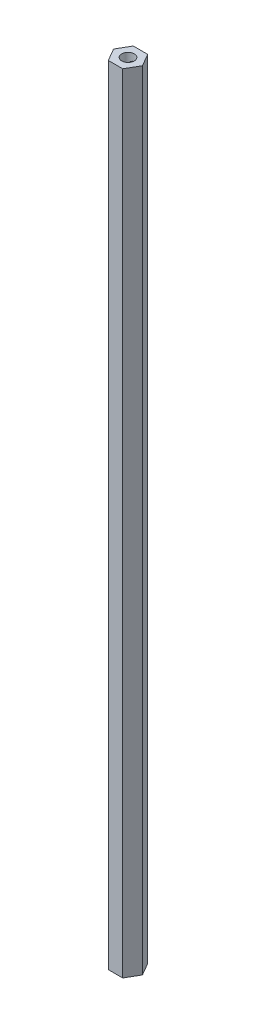
ISO-10303-21;
HEADER;
FILE_DESCRIPTION(('STEP AP214'),'2;1');
FILE_NAME('part.step','',(''),(''),'','','');
FILE_SCHEMA(('AUTOMOTIVE_DESIGN { 1 0 10303 214 1 1 1 1 }'));
ENDSEC;
DATA;
#1=APPLICATION_CONTEXT('core data for automotive mechanical design processes');
#2=APPLICATION_PROTOCOL_DEFINITION('international standard','automotive_design',2000,#1);
#3=PRODUCT_CONTEXT('',#1,'mechanical');
#4=PRODUCT('Part','Part','',(#3));
#5=PRODUCT_RELATED_PRODUCT_CATEGORY('part','',(#4));
#6=PRODUCT_DEFINITION_FORMATION('','',#4);
#7=PRODUCT_DEFINITION_CONTEXT('part definition',#1,'design');
#8=PRODUCT_DEFINITION('design','',#6,#7);
#9=PRODUCT_DEFINITION_SHAPE('','',#8);
#10=(LENGTH_UNIT() NAMED_UNIT(*) SI_UNIT(.MILLI.,.METRE.));
#11=(NAMED_UNIT(*) PLANE_ANGLE_UNIT() SI_UNIT($,.RADIAN.));
#12=(NAMED_UNIT(*) SI_UNIT($,.STERADIAN.) SOLID_ANGLE_UNIT());
#13=UNCERTAINTY_MEASURE_WITH_UNIT(LENGTH_MEASURE(1.E-05),#10,'distance_accuracy_value','');
#14=(GEOMETRIC_REPRESENTATION_CONTEXT(3) GLOBAL_UNCERTAINTY_ASSIGNED_CONTEXT((#13)) GLOBAL_UNIT_ASSIGNED_CONTEXT((#10,
#11,#12)) REPRESENTATION_CONTEXT('',''));
#15=CARTESIAN_POINT('',(0.,0.,0.));
#16=DIRECTION('',(0.,0.,1.));
#17=DIRECTION('',(1.,0.,0.));
#18=AXIS2_PLACEMENT_3D('',#15,#16,#17);
#19=CARTESIAN_POINT('',(3.66617420935412,200.,6.35));
#20=DIRECTION('',(-0.866025403784439,0.,-0.5));
#21=DIRECTION('',(-0.5,0.,0.866025403784439));
#22=AXIS2_PLACEMENT_3D('',#19,#20,#21);
#23=PLANE('',#22);
#24=DIRECTION('',(0.5,0.,-0.866025403784439));
#25=VECTOR('',#24,1.);
#26=CARTESIAN_POINT('',(3.66617420935412,-200.,6.35));
#27=LINE('',#26,#25);
#28=CARTESIAN_POINT('',(3.66617420935412,-200.,6.35));
#29=VERTEX_POINT('',#28);
#30=CARTESIAN_POINT('',(7.33234841870825,-200.,0.));
#31=VERTEX_POINT('',#30);
#32=EDGE_CURVE('E123',#29,#31,#27,.T.);
#33=ORIENTED_EDGE('',*,*,#32,.T.);
#34=DIRECTION('',(0.,-1.,0.));
#35=VECTOR('',#34,1.);
#36=CARTESIAN_POINT('',(7.33234841870825,200.,0.));
#37=LINE('',#36,#35);
#38=CARTESIAN_POINT('',(7.33234841870825,200.,0.));
#39=VERTEX_POINT('',#38);
#40=EDGE_CURVE('E11',#39,#31,#37,.T.);
#41=ORIENTED_EDGE('',*,*,#40,.F.);
#42=DIRECTION('',(0.5,0.,-0.866025403784439));
#43=VECTOR('',#42,1.);
#44=CARTESIAN_POINT('',(3.66617420935412,200.,6.35));
#45=LINE('',#44,#43);
#46=CARTESIAN_POINT('',(3.66617420935412,200.,6.35));
#47=VERTEX_POINT('',#46);
#48=EDGE_CURVE('E134',#47,#39,#45,.T.);
#49=ORIENTED_EDGE('',*,*,#48,.F.);
#50=DIRECTION('',(0.,-1.,0.));
#51=VECTOR('',#50,1.);
#52=CARTESIAN_POINT('',(3.66617420935412,200.,6.35));
#53=LINE('',#52,#51);
#54=EDGE_CURVE('E119',#47,#29,#53,.T.);
#55=ORIENTED_EDGE('',*,*,#54,.T.);
#56=EDGE_LOOP('',(#33,#41,#49,#55));
#57=FACE_BOUND('',#56,.T.);
#58=ADVANCED_FACE('F36',(#57),#23,.F.);
#59=CARTESIAN_POINT('',(7.33234841870825,200.,0.));
#60=DIRECTION('',(-0.866025403784438,0.,0.5));
#61=DIRECTION('',(0.5,0.,0.866025403784439));
#62=AXIS2_PLACEMENT_3D('',#59,#60,#61);
#63=PLANE('',#62);
#64=DIRECTION('',(-0.5,0.,-0.866025403784438));
#65=VECTOR('',#64,1.);
#66=CARTESIAN_POINT('',(7.33234841870825,-200.,0.));
#67=LINE('',#66,#65);
#68=CARTESIAN_POINT('',(3.66617420935412,-200.,-6.35));
#69=VERTEX_POINT('',#68);
#70=EDGE_CURVE('E126',#31,#69,#67,.T.);
#71=ORIENTED_EDGE('',*,*,#70,.T.);
#72=DIRECTION('',(0.,-1.,0.));
#73=VECTOR('',#72,1.);
#74=CARTESIAN_POINT('',(3.66617420935412,200.,-6.35));
#75=LINE('',#74,#73);
#76=CARTESIAN_POINT('',(3.66617420935412,200.,-6.35));
#77=VERTEX_POINT('',#76);
#78=EDGE_CURVE('E44',#77,#69,#75,.T.);
#79=ORIENTED_EDGE('',*,*,#78,.F.);
#80=DIRECTION('',(-0.5,0.,-0.866025403784438));
#81=VECTOR('',#80,1.);
#82=CARTESIAN_POINT('',(7.33234841870825,200.,0.));
#83=LINE('',#82,#81);
#84=EDGE_CURVE('E90',#39,#77,#83,.T.);
#85=ORIENTED_EDGE('',*,*,#84,.F.);
#86=ORIENTED_EDGE('',*,*,#40,.T.);
#87=EDGE_LOOP('',(#71,#79,#85,#86));
#88=FACE_BOUND('',#87,.T.);
#89=ADVANCED_FACE('F162',(#88),#63,.F.);
#90=CARTESIAN_POINT('',(3.66617420935412,200.,-6.35));
#91=DIRECTION('',(0.,0.,1.));
#92=DIRECTION('',(1.,0.,0.));
#93=AXIS2_PLACEMENT_3D('',#90,#91,#92);
#94=PLANE('',#93);
#95=CARTESIAN_POINT('',(0.,-194.,-6.35));
#96=DIRECTION('',(0.,0.,-1.));
#97=DIRECTION('',(-1.,0.,0.));
#98=AXIS2_PLACEMENT_3D('',#95,#96,#97);
#99=CIRCLE('',#98,2.49999999999999);
#100=CARTESIAN_POINT('',(-2.49999999999999,-194.,-6.35));
#101=VERTEX_POINT('',#100);
#102=EDGE_CURVE('E337',#101,#101,#99,.T.);
#103=ORIENTED_EDGE('',*,*,#102,.F.);
#104=EDGE_LOOP('',(#103));
#105=FACE_BOUND('',#104,.T.);
#106=CARTESIAN_POINT('',(0.,194.,-6.35));
#107=DIRECTION('',(0.,0.,-1.));
#108=DIRECTION('',(-1.,0.,0.));
#109=AXIS2_PLACEMENT_3D('',#106,#107,#108);
#110=CIRCLE('',#109,2.49999999999999);
#111=CARTESIAN_POINT('',(-2.49999999999999,194.,-6.35));
#112=VERTEX_POINT('',#111);
#113=EDGE_CURVE('E309',#112,#112,#110,.T.);
#114=ORIENTED_EDGE('',*,*,#113,.F.);
#115=EDGE_LOOP('',(#114));
#116=FACE_BOUND('',#115,.T.);
#117=DIRECTION('',(-1.,0.,0.));
#118=VECTOR('',#117,1.);
#119=CARTESIAN_POINT('',(3.66617420935412,-200.,-6.35));
#120=LINE('',#119,#118);
#121=CARTESIAN_POINT('',(-3.66617420935412,-200.,-6.35));
#122=VERTEX_POINT('',#121);
#123=EDGE_CURVE('E129',#69,#122,#120,.T.);
#124=ORIENTED_EDGE('',*,*,#123,.T.);
#125=DIRECTION('',(0.,-1.,0.));
#126=VECTOR('',#125,1.);
#127=CARTESIAN_POINT('',(-3.66617420935412,200.,-6.35));
#128=LINE('',#127,#126);
#129=CARTESIAN_POINT('',(-3.66617420935412,200.,-6.35));
#130=VERTEX_POINT('',#129);
#131=EDGE_CURVE('E114',#130,#122,#128,.T.);
#132=ORIENTED_EDGE('',*,*,#131,.F.);
#133=DIRECTION('',(-1.,0.,0.));
#134=VECTOR('',#133,1.);
#135=CARTESIAN_POINT('',(3.66617420935412,200.,-6.35));
#136=LINE('',#135,#134);
#137=EDGE_CURVE('E105',#77,#130,#136,.T.);
#138=ORIENTED_EDGE('',*,*,#137,.F.);
#139=ORIENTED_EDGE('',*,*,#78,.T.);
#140=EDGE_LOOP('',(#124,#132,#138,#139));
#141=FACE_BOUND('',#140,.T.);
#142=ADVANCED_FACE('F140',(#105,#116,#141),#94,.F.);
#143=CARTESIAN_POINT('',(-3.66617420935412,200.,-6.35));
#144=DIRECTION('',(0.866025403784439,0.,0.5));
#145=DIRECTION('',(0.5,0.,-0.866025403784439));
#146=AXIS2_PLACEMENT_3D('',#143,#144,#145);
#147=PLANE('',#146);
#148=DIRECTION('',(-0.5,0.,0.866025403784439));
#149=VECTOR('',#148,1.);
#150=CARTESIAN_POINT('',(-3.66617420935412,-200.,-6.35));
#151=LINE('',#150,#149);
#152=CARTESIAN_POINT('',(-7.33234841870825,-200.,0.));
#153=VERTEX_POINT('',#152);
#154=EDGE_CURVE('E113',#122,#153,#151,.T.);
#155=ORIENTED_EDGE('',*,*,#154,.T.);
#156=DIRECTION('',(0.,-1.,0.));
#157=VECTOR('',#156,1.);
#158=CARTESIAN_POINT('',(-7.33234841870825,200.,0.));
#159=LINE('',#158,#157);
#160=CARTESIAN_POINT('',(-7.33234841870825,200.,0.));
#161=VERTEX_POINT('',#160);
#162=EDGE_CURVE('E110',#161,#153,#159,.T.);
#163=ORIENTED_EDGE('',*,*,#162,.F.);
#164=DIRECTION('',(-0.5,0.,0.866025403784439));
#165=VECTOR('',#164,1.);
#166=CARTESIAN_POINT('',(-3.66617420935412,200.,-6.35));
#167=LINE('',#166,#165);
#168=EDGE_CURVE('E99',#130,#161,#167,.T.);
#169=ORIENTED_EDGE('',*,*,#168,.F.);
#170=ORIENTED_EDGE('',*,*,#131,.T.);
#171=EDGE_LOOP('',(#155,#163,#169,#170));
#172=FACE_BOUND('',#171,.T.);
#173=ADVANCED_FACE('F111',(#172),#147,.F.);
#174=CARTESIAN_POINT('',(-7.33234841870825,200.,0.));
#175=DIRECTION('',(0.866025403784439,0.,-0.5));
#176=DIRECTION('',(-0.5,0.,-0.866025403784439));
#177=AXIS2_PLACEMENT_3D('',#174,#175,#176);
#178=PLANE('',#177);
#179=CARTESIAN_POINT('',(-5.49926131403119,194.,3.175));
#180=DIRECTION('',(-0.866025403784438,0.,0.5));
#181=DIRECTION('',(0.5,0.,0.866025403784439));
#182=AXIS2_PLACEMENT_3D('',#179,#180,#181);
#183=CIRCLE('',#182,2.49999999999997);
#184=CARTESIAN_POINT('',(-4.2492613140312,194.,5.34006350946108));
#185=VERTEX_POINT('',#184);
#186=EDGE_CURVE('E358',#185,#185,#183,.T.);
#187=ORIENTED_EDGE('',*,*,#186,.F.);
#188=EDGE_LOOP('',(#187));
#189=FACE_BOUND('',#188,.T.);
#190=CARTESIAN_POINT('',(-5.49926131403119,-194.,3.175));
#191=DIRECTION('',(-0.866025403784438,0.,0.5));
#192=DIRECTION('',(0.5,0.,0.866025403784439));
#193=AXIS2_PLACEMENT_3D('',#190,#191,#192);
#194=CIRCLE('',#193,2.5);
#195=CARTESIAN_POINT('',(-4.24926131403119,-194.,5.3400635094611));
#196=VERTEX_POINT('',#195);
#197=EDGE_CURVE('E350',#196,#196,#194,.T.);
#198=ORIENTED_EDGE('',*,*,#197,.F.);
#199=EDGE_LOOP('',(#198));
#200=FACE_BOUND('',#199,.T.);
#201=DIRECTION('',(0.5,0.,0.866025403784439));
#202=VECTOR('',#201,1.);
#203=CARTESIAN_POINT('',(-7.33234841870825,-200.,0.));
#204=LINE('',#203,#202);
#205=CARTESIAN_POINT('',(-3.66617420935412,-200.,6.35));
#206=VERTEX_POINT('',#205);
#207=EDGE_CURVE('E76',#153,#206,#204,.T.);
#208=ORIENTED_EDGE('',*,*,#207,.T.);
#209=DIRECTION('',(0.,-1.,0.));
#210=VECTOR('',#209,1.);
#211=CARTESIAN_POINT('',(-3.66617420935412,200.,6.35));
#212=LINE('',#211,#210);
#213=CARTESIAN_POINT('',(-3.66617420935412,200.,6.35));
#214=VERTEX_POINT('',#213);
#215=EDGE_CURVE('E115',#214,#206,#212,.T.);
#216=ORIENTED_EDGE('',*,*,#215,.F.);
#217=DIRECTION('',(0.5,0.,0.866025403784439));
#218=VECTOR('',#217,1.);
#219=CARTESIAN_POINT('',(-7.33234841870825,200.,0.));
#220=LINE('',#219,#218);
#221=EDGE_CURVE('E103',#161,#214,#220,.T.);
#222=ORIENTED_EDGE('',*,*,#221,.F.);
#223=ORIENTED_EDGE('',*,*,#162,.T.);
#224=EDGE_LOOP('',(#208,#216,#222,#223));
#225=FACE_BOUND('',#224,.T.);
#226=ADVANCED_FACE('F117',(#189,#200,#225),#178,.F.);
#227=CARTESIAN_POINT('',(-3.66617420935412,200.,6.35));
#228=DIRECTION('',(0.,0.,-1.));
#229=DIRECTION('',(-1.,0.,0.));
#230=AXIS2_PLACEMENT_3D('',#227,#228,#229);
#231=PLANE('',#230);
#232=DIRECTION('',(1.,0.,0.));
#233=VECTOR('',#232,1.);
#234=CARTESIAN_POINT('',(-3.66617420935412,-200.,6.35));
#235=LINE('',#234,#233);
#236=EDGE_CURVE('E82',#206,#29,#235,.T.);
#237=ORIENTED_EDGE('',*,*,#236,.T.);
#238=ORIENTED_EDGE('',*,*,#54,.F.);
#239=DIRECTION('',(1.,0.,0.));
#240=VECTOR('',#239,1.);
#241=CARTESIAN_POINT('',(-3.66617420935412,200.,6.35));
#242=LINE('',#241,#240);
#243=EDGE_CURVE('E52',#214,#47,#242,.T.);
#244=ORIENTED_EDGE('',*,*,#243,.F.);
#245=ORIENTED_EDGE('',*,*,#215,.T.);
#246=EDGE_LOOP('',(#237,#238,#244,#245));
#247=FACE_BOUND('',#246,.T.);
#248=ADVANCED_FACE('F147',(#247),#231,.F.);
#249=CARTESIAN_POINT('',(0.,200.,0.));
#250=DIRECTION('',(0.,1.,0.));
#251=DIRECTION('',(0.,0.,1.));
#252=AXIS2_PLACEMENT_3D('',#249,#250,#251);
#253=PLANE('',#252);
#254=CARTESIAN_POINT('',(0.,200.,0.));
#255=DIRECTION('',(0.,1.,0.));
#256=DIRECTION('',(0.,0.,1.));
#257=AXIS2_PLACEMENT_3D('',#254,#255,#256);
#258=CIRCLE('',#257,3.175);
#259=CARTESIAN_POINT('',(0.,200.,3.175));
#260=VERTEX_POINT('',#259);
#261=EDGE_CURVE('E316',#260,#260,#258,.T.);
#262=ORIENTED_EDGE('',*,*,#261,.F.);
#263=EDGE_LOOP('',(#262));
#264=FACE_BOUND('',#263,.T.);
#265=ORIENTED_EDGE('',*,*,#48,.T.);
#266=ORIENTED_EDGE('',*,*,#84,.T.);
#267=ORIENTED_EDGE('',*,*,#137,.T.);
#268=ORIENTED_EDGE('',*,*,#168,.T.);
#269=ORIENTED_EDGE('',*,*,#221,.T.);
#270=ORIENTED_EDGE('',*,*,#243,.T.);
#271=EDGE_LOOP('',(#265,#266,#267,#268,#269,#270));
#272=FACE_BOUND('',#271,.T.);
#273=ADVANCED_FACE('F101',(#264,#272),#253,.T.);
#274=CARTESIAN_POINT('',(0.,-200.,0.));
#275=DIRECTION('',(0.,1.,0.));
#276=DIRECTION('',(0.,0.,1.));
#277=AXIS2_PLACEMENT_3D('',#274,#275,#276);
#278=PLANE('',#277);
#279=CARTESIAN_POINT('',(0.,-200.,0.));
#280=DIRECTION('',(0.,-1.,0.));
#281=DIRECTION('',(0.,0.,-1.));
#282=AXIS2_PLACEMENT_3D('',#279,#280,#281);
#283=CIRCLE('',#282,3.175);
#284=CARTESIAN_POINT('',(0.,-200.,-3.175));
#285=VERTEX_POINT('',#284);
#286=EDGE_CURVE('E308',#285,#285,#283,.T.);
#287=ORIENTED_EDGE('',*,*,#286,.F.);
#288=EDGE_LOOP('',(#287));
#289=FACE_BOUND('',#288,.T.);
#290=ORIENTED_EDGE('',*,*,#32,.F.);
#291=ORIENTED_EDGE('',*,*,#236,.F.);
#292=ORIENTED_EDGE('',*,*,#207,.F.);
#293=ORIENTED_EDGE('',*,*,#154,.F.);
#294=ORIENTED_EDGE('',*,*,#123,.F.);
#295=ORIENTED_EDGE('',*,*,#70,.F.);
#296=EDGE_LOOP('',(#290,#291,#292,#293,#294,#295));
#297=FACE_BOUND('',#296,.T.);
#298=ADVANCED_FACE('F143',(#289,#297),#278,.F.);
#299=CARTESIAN_POINT('',(0.,180.,0.));
#300=DIRECTION('',(0.,1.,0.));
#301=DIRECTION('',(0.,0.,1.));
#302=AXIS2_PLACEMENT_3D('',#299,#300,#301);
#303=CONICAL_SURFACE('',#302,3.17499999999999,1.02974425867665);
#304=CARTESIAN_POINT('',(0.,178.092267534588,0.));
#305=VERTEX_POINT('',#304);
#306=VERTEX_LOOP('',#305);
#307=FACE_BOUND('',#306,.T.);
#308=CARTESIAN_POINT('',(0.,180.,0.));
#309=DIRECTION('',(0.,1.,0.));
#310=DIRECTION('',(0.,0.,1.));
#311=AXIS2_PLACEMENT_3D('',#308,#309,#310);
#312=CIRCLE('',#311,3.17499999999999);
#313=CARTESIAN_POINT('',(0.,180.,3.17499999999999));
#314=VERTEX_POINT('',#313);
#315=EDGE_CURVE('E127',#314,#314,#312,.T.);
#316=ORIENTED_EDGE('',*,*,#315,.T.);
#317=EDGE_LOOP('',(#316));
#318=FACE_BOUND('',#317,.T.);
#319=ADVANCED_FACE('F199',(#307,#318),#303,.F.);
#320=CARTESIAN_POINT('',(0.,200.,0.));
#321=DIRECTION('',(0.,1.,0.));
#322=DIRECTION('',(0.,0.,1.));
#323=AXIS2_PLACEMENT_3D('',#320,#321,#322);
#324=CYLINDRICAL_SURFACE('',#323,3.175);
#325=CARTESIAN_POINT('',(-0.444983406998439,194.,3.14366263576358));
#326=CARTESIAN_POINT('',(-0.444996995344941,194.095780677247,3.14366409823169));
#327=CARTESIAN_POINT('',(-0.453979292016389,194.191731641422,3.14242862568083));
#328=CARTESIAN_POINT('',(-0.488470053402809,194.380637183561,3.13724406145098));
#329=CARTESIAN_POINT('',(-0.514033143210928,194.47358078741,3.13328599763252));
#330=CARTESIAN_POINT('',(-0.589118769872573,194.684767129696,3.12016598165727));
#331=CARTESIAN_POINT('',(-0.643796857771062,194.801065533529,3.10970568433576));
#332=CARTESIAN_POINT('',(-0.768949157633939,195.023872040012,3.08114633052032));
#333=CARTESIAN_POINT('',(-0.839466137320342,195.130352513521,3.06302647282521));
#334=CARTESIAN_POINT('',(-0.965597202759653,195.299744498159,3.02506979644189));
#335=CARTESIAN_POINT('',(-1.01838658621612,195.365384371508,3.00780016564516));
#336=CARTESIAN_POINT('',(-1.12739762372617,195.492307509817,2.96866284608294));
#337=CARTESIAN_POINT('',(-1.18362042641613,195.553589301792,2.94679361249255));
#338=CARTESIAN_POINT('',(-1.35584862884774,195.730646780123,2.87363753783605));
#339=CARTESIAN_POINT('',(-1.47560906394775,195.839887085861,2.81474932139681));
#340=CARTESIAN_POINT('',(-1.69482075810722,196.018987095228,2.68721168505667));
#341=CARTESIAN_POINT('',(-1.7937580375787,196.092380990213,2.62260537081372));
#342=CARTESIAN_POINT('',(-1.9899582836853,196.223490113705,2.4770015756832));
#343=CARTESIAN_POINT('',(-2.08722358792458,196.281229243389,2.39602941536086));
#344=CARTESIAN_POINT('',(-2.26098041361335,196.370457703207,2.23171691009273));
#345=CARTESIAN_POINT('',(-2.33833043073598,196.404649565264,2.15075982971843));
#346=CARTESIAN_POINT('',(-2.48602281449163,196.458072396592,1.9781765706414));
#347=CARTESIAN_POINT('',(-2.55636892439218,196.477311395313,1.88655614841826));
#348=CARTESIAN_POINT('',(-2.68756521837787,196.499664553648,1.69445694953954));
#349=CARTESIAN_POINT('',(-2.74838429450358,196.502726915701,1.59395076380011));
#350=CARTESIAN_POINT('',(-2.85818395676486,196.492373548854,1.38747380249844));
#351=CARTESIAN_POINT('',(-2.90716363798289,196.478956560866,1.28150260998133));
#352=CARTESIAN_POINT('',(-2.99019564917554,196.437609594302,1.07300039430847));
#353=CARTESIAN_POINT('',(-3.02487249715819,196.410439755988,0.970562719078406));
#354=CARTESIAN_POINT('',(-3.08287172627453,196.34344231111,0.766665103452073));
#355=CARTESIAN_POINT('',(-3.1061913234747,196.303611605014,0.665205408750355));
#356=CARTESIAN_POINT('',(-3.14413483953365,196.208358018,0.455520057201279));
#357=CARTESIAN_POINT('',(-3.15766139846145,196.151777320051,0.34762694266734));
#358=CARTESIAN_POINT('',(-3.17375394533734,196.027150814043,0.137841664316999));
#359=CARTESIAN_POINT('',(-3.17631300743305,195.959097789515,0.0359533324891913));
#360=CARTESIAN_POINT('',(-3.17207891807633,195.798046904593,-0.180237157481917));
#361=CARTESIAN_POINT('',(-3.16326639285654,195.702793771299,-0.292817438603984));
#362=CARTESIAN_POINT('',(-3.13649663375655,195.499150689941,-0.504356184525455));
#363=CARTESIAN_POINT('',(-3.11852979120149,195.390747029924,-0.603300197323241));
#364=CARTESIAN_POINT('',(-3.08066460710913,195.175864497173,-0.77242866724904));
#365=CARTESIAN_POINT('',(-3.06130770997906,195.070914719527,-0.844673166697866));
#366=CARTESIAN_POINT('',(-3.02318046049082,194.851127192214,-0.972330891804104));
#367=CARTESIAN_POINT('',(-3.0044089007141,194.736311925304,-1.02778114952163));
#368=CARTESIAN_POINT('',(-2.97699540721517,194.530124355241,-1.10422524577204));
#369=CARTESIAN_POINT('',(-2.96698714959803,194.440921231107,-1.13049431076655));
#370=CARTESIAN_POINT('',(-2.95214078992384,194.25913829552,-1.16872824736811));
#371=CARTESIAN_POINT('',(-2.94729233491295,194.166565632599,-1.18072176808135));
#372=CARTESIAN_POINT('',(-2.94397870378626,193.980172669485,-1.18896716163643));
#373=CARTESIAN_POINT('',(-2.94554115377461,193.886348709928,-1.18515090573291));
#374=CARTESIAN_POINT('',(-2.95468816449602,193.700866915356,-1.16214412069451));
#375=CARTESIAN_POINT('',(-2.96228158924884,193.609212473331,-1.14293096160123));
#376=CARTESIAN_POINT('',(-2.98447292579285,193.404591409255,-1.08387468969428));
#377=CARTESIAN_POINT('',(-3.0004556251488,193.293057233768,-1.0396934846267));
#378=CARTESIAN_POINT('',(-3.0348509470372,193.078496850353,-0.93453408110223));
#379=CARTESIAN_POINT('',(-3.05327095785951,192.975498124972,-0.873504171882924));
#380=CARTESIAN_POINT('',(-3.08345726580705,192.807487413017,-0.758513458775513));
#381=CARTESIAN_POINT('',(-3.09557809260628,192.740261539143,-0.70781478830425));
#382=CARTESIAN_POINT('',(-3.11810525896758,192.610062051195,-0.600863634532556));
#383=CARTESIAN_POINT('',(-3.12851091920268,192.547090127787,-0.544608964703947));
#384=CARTESIAN_POINT('',(-3.15575480492486,192.364654126467,-0.368609587759333));
#385=CARTESIAN_POINT('',(-3.16865621578096,192.251494658765,-0.24150596088291));
#386=CARTESIAN_POINT('',(-3.17706273963447,192.059783522563,0.00753809139718041));
#387=CARTESIAN_POINT('',(-3.17489333970609,191.978586488259,0.127377716304884));
#388=CARTESIAN_POINT('',(-3.15517752618242,191.832284351849,0.375318088926815));
#389=CARTESIAN_POINT('',(-3.13765738805521,191.767151996251,0.503404374108776));
#390=CARTESIAN_POINT('',(-3.08922922944145,191.665920488682,0.74115483298181));
#391=CARTESIAN_POINT('',(-3.06122510126526,191.626727500394,0.850086980584443));
#392=CARTESIAN_POINT('',(-2.99209795738313,191.563312005294,1.06818828250139));
#393=CARTESIAN_POINT('',(-2.95098246264799,191.539080939332,1.17735726539235));
#394=CARTESIAN_POINT('',(-2.85558260955112,191.507013303709,1.39291552735472));
#395=CARTESIAN_POINT('',(-2.80124350309638,191.499246230839,1.49929115859066));
#396=CARTESIAN_POINT('',(-2.68093926258766,191.500869366647,1.70510771239568));
#397=CARTESIAN_POINT('',(-2.61497493363347,191.510258387609,1.80454911452665));
#398=CARTESIAN_POINT('',(-2.47879244711097,191.544309199585,1.98703299358433));
#399=CARTESIAN_POINT('',(-2.40917156561584,191.56788528113,2.07073142597999));
#400=CARTESIAN_POINT('',(-2.26446409214146,191.628067071007,2.22806256117058));
#401=CARTESIAN_POINT('',(-2.18937617870367,191.664675937919,2.30169281788476));
#402=CARTESIAN_POINT('',(-2.03000450061623,191.75273991491,2.44376761013906));
#403=CARTESIAN_POINT('',(-1.945465205361,191.80514706531,2.51132862259258));
#404=CARTESIAN_POINT('',(-1.77547816862767,191.92143029909,2.63425982039957));
#405=CARTESIAN_POINT('',(-1.69003001685843,191.985311788796,2.68962423162438));
#406=CARTESIAN_POINT('',(-1.50393550772983,192.136548284109,2.7986771328254));
#407=CARTESIAN_POINT('',(-1.40359617977823,192.22604974276,2.84990604641452));
#408=CARTESIAN_POINT('',(-1.20869490782708,192.417773864809,2.93787723339006));
#409=CARTESIAN_POINT('',(-1.11414085871496,192.52001335822,2.97460006794249));
#410=CARTESIAN_POINT('',(-0.938919129174925,192.732335205912,3.03434823141605));
#411=CARTESIAN_POINT('',(-0.857851615220983,192.841951090643,3.05785538381985));
#412=CARTESIAN_POINT('',(-0.711047686522316,193.072586988351,3.09527837523737));
#413=CARTESIAN_POINT('',(-0.645283472637669,193.193585753125,3.10921169693508));
#414=CARTESIAN_POINT('',(-0.553790332391528,193.408633270412,3.12656969268792));
#415=CARTESIAN_POINT('',(-0.521970046279559,193.499909800105,3.13189141461957));
#416=CARTESIAN_POINT('',(-0.473775656465832,193.686454628027,3.13955102754845));
#417=CARTESIAN_POINT('',(-0.457343113615132,193.781706376884,3.14190021958342));
#418=CARTESIAN_POINT('',(-0.448195766147376,193.897898982197,3.14320610844882));
#419=CARTESIAN_POINT('',(-0.446993752151906,193.918296916852,3.14337756248162));
#420=CARTESIAN_POINT('',(-0.445386063312683,193.959127312788,3.14360567864325));
#421=CARTESIAN_POINT('',(-0.444980507156668,193.979559778761,3.14366232366335));
#422=CARTESIAN_POINT('',(-0.444983406998439,194.,3.14366263576358));
#423=B_SPLINE_CURVE_WITH_KNOTS('',3,(#325,#326,#327,#328,#329,#330,#331,#332,#333,#334,#335,
#336,#337,#338,#339,#340,#341,#342,#343,#344,#345,#346,#347,#348,#349,#350,#351,#352,#353,#354,
#355,#356,#357,#358,#359,#360,#361,#362,#363,#364,#365,#366,#367,#368,#369,#370,#371,#372,#373,
#374,#375,#376,#377,#378,#379,#380,#381,#382,#383,#384,#385,#386,#387,#388,#389,#390,#391,#392,
#393,#394,#395,#396,#397,#398,#399,#400,#401,#402,#403,#404,#405,#406,#407,#408,#409,#410,#411,
#412,#413,#414,#415,#416,#417,#418,#419,#420,#421,#422),.UNSPECIFIED.,.T.,.F.,(4,2,2,2,2,2,2,2,
2,2,2,2,2,2,2,2,2,2,2,2,2,2,2,2,2,2,2,2,2,2,2,2,2,2,2,2,2,2,2,2,2,2,2,2,2,2,2,2,4),(0.,
0.287252325627651,0.575455838274759,0.960121318810391,1.34583822218932,1.60349953630363,
1.86124752726356,2.37578413095272,2.79155991718982,3.20669728966615,3.55642581001498,
3.90596640167381,4.25662554616212,4.60731148402481,4.94044215163292,5.27365443647926,
5.6400530721912,6.0066830505091,6.44828270637191,6.89034683769378,7.27583733434135,
7.66047151249735,7.93998265633267,8.21893190782197,8.49908447719317,8.77964956421465,
9.14073286425412,9.50293693566538,9.75783651820511,10.0128368176257,10.5221928227142,
10.9549071669286,11.3868822887833,11.742721102557,12.098356165351,12.4554894477908,
12.8125980068311,13.1453423572624,13.4781674054196,13.8375680441359,14.1971384667908,
14.6272495168196,15.0579349965136,15.4716853910443,15.8846782173802,16.174069257423,
16.4623567449391,16.5236491317193,16.5849506515666),.UNSPECIFIED.);
#424=CARTESIAN_POINT('',(-0.444983406998439,194.,3.14366263576358));
#425=VERTEX_POINT('',#424);
#426=EDGE_CURVE('E353',#425,#425,#423,.T.);
#427=ORIENTED_EDGE('',*,*,#426,.T.);
#428=EDGE_LOOP('',(#427));
#429=FACE_BOUND('',#428,.T.);
#430=CARTESIAN_POINT('',(-2.49999999999999,194.,-1.95719825260498));
#431=CARTESIAN_POINT('',(-2.49999447236127,194.095780677247,-1.95721075169231));
#432=CARTESIAN_POINT('',(-2.49443337341083,194.191731641422,-1.96437191251867));
#433=CARTESIAN_POINT('',(-2.47269802838702,194.380637183561,-1.99164950596025));
#434=CARTESIAN_POINT('',(-2.45648869966637,194.47358078741,-2.01180875922408));
#435=CARTESIAN_POINT('',(-2.40758361920292,194.684767129696,-2.07027481138452));
#436=CARTESIAN_POINT('',(-2.37118569204211,194.801065533529,-2.11239727587422));
#437=CARTESIAN_POINT('',(-2.28387641619083,195.023872040012,-2.2065026699898));
#438=CARTESIAN_POINT('',(-2.23292566927071,195.130352513521,-2.25851223694882));
#439=CARTESIAN_POINT('',(-2.13698869055987,195.299744498159,-2.34876660563399));
#440=CARTESIAN_POINT('',(-2.09563805984769,195.365384371508,-2.38584873735905));
#441=CARTESIAN_POINT('',(-2.00723862811575,195.492307509817,-2.46068640535455));
#442=CARTESIAN_POINT('',(-1.9601879149202,195.553589301792,-2.49844216396082));
#443=CARTESIAN_POINT('',(-1.81071879461071,195.730646780123,-2.61101812518647));
#444=CARTESIAN_POINT('',(-1.69983988564078,195.839887085861,-2.68528959613173));
#445=CARTESIAN_POINT('',(-1.47978320555185,196.018987095228,-2.81136367391039));
#446=CARTESIAN_POINT('',(-1.37436385643683,196.092380990213,-2.86474271419254));
#447=CARTESIAN_POINT('',(-1.15016714791308,196.223490113705,-2.96185521398436));
#448=CARTESIAN_POINT('',(-1.03141054795499,196.281229243389,-3.00560335820122));
#449=CARTESIAN_POINT('',(-0.802233331388955,196.370457703207,-3.07392493069457));
#450=CARTESIAN_POINT('',(-0.69344743460727,196.404649565264,-3.10043347031878));
#451=CARTESIAN_POINT('',(-0.47013975610082,196.458072396592,-3.14204719705814));
#452=CARTESIAN_POINT('',(-0.355621087999852,196.477311395313,-3.15715850417786));
#453=CARTESIAN_POINT('',(-0.123660154731397,196.499664553648,-3.17472822821248));
#454=CARTESIAN_POINT('',(-0.00620970658071292,196.502726915701,-3.17714600030233));
#455=CARTESIAN_POINT('',(0.227504418333385,196.492373548854,-3.16899681649671));
#456=CARTESIAN_POINT('',(0.343768003731551,196.478956560866,-3.15842886844223));
#457=CARTESIAN_POINT('',(0.56585222484591,196.437609594302,-3.12608559162596));
#458=CARTESIAN_POINT('',(0.671904277891097,196.410439755988,-3.10489778528707));
#459=CARTESIAN_POINT('',(0.877484407352749,196.34344231111,-3.05317778328857));
#460=CARTESIAN_POINT('',(0.97701087902473,196.303611605014,-3.02264329951908));
#461=CARTESIAN_POINT('',(1.17757547829717,196.208358018,-2.95066067256049));
#462=CARTESIAN_POINT('',(1.27777693584089,196.151777320051,-2.90842845895079));
#463=CARTESIAN_POINT('',(1.46750258967022,196.027150814043,-2.81747237418172));
#464=CARTESIAN_POINT('',(1.55702000443017,195.959097789515,-2.76874442105257));
#465=CARTESIAN_POINT('',(1.7421294161234,195.798046904593,-2.6569823471222));
#466=CARTESIAN_POINT('',(1.83522053693041,195.702793771299,-2.59306033584933));
#467=CARTESIAN_POINT('',(2.00503358523312,195.499150689941,-2.46410767145482));
#468=CARTESIAN_POINT('',(2.08173819259084,195.390747029924,-2.39907592297744));
#469=CARTESIAN_POINT('',(2.20927515200359,195.175864497174,-2.28171947667159));
#470=CARTESIAN_POINT('',(2.26216227524493,195.070914719527,-2.2288336622941));
#471=CARTESIAN_POINT('',(2.35365348343214,194.851127192214,-2.13198563310774));
#472=CARTESIAN_POINT('',(2.39228903537356,194.736311925304,-2.08800385661366));
#473=CARTESIAN_POINT('',(2.44478481794629,194.530124355241,-2.02604102671191));
#474=CARTESIAN_POINT('',(2.46253036675663,194.440921231107,-2.0042390888706));
#475=CARTESIAN_POINT('',(2.48821874730316,194.25913829552,-1.97226479593824));
#476=CARTESIAN_POINT('',(2.49618121341621,194.166565632599,-1.96206915037308));
#477=CARTESIAN_POINT('',(2.50166511813576,193.980172669485,-1.95507676486106));
#478=CARTESIAN_POINT('',(2.49914136857014,193.886348709928,-1.95833801419488));
#479=CARTESIAN_POINT('',(2.48379041362818,193.700866915356,-1.97776295036751));
#480=CARTESIAN_POINT('',(2.47094804214286,193.609212473331,-1.99394562865182));
#481=CARTESIAN_POINT('',(2.43089947869065,193.404591409255,-2.04269202579633));
#482=CARTESIAN_POINT('',(2.40062878241029,193.293057233768,-2.07862405199342));
#483=CARTESIAN_POINT('',(2.32675572845549,193.078496850353,-2.16099097628236));
#484=CARTESIAN_POINT('',(2.28311228209206,192.975498124972,-2.20745812820211));
#485=CARTESIAN_POINT('',(2.19862055731553,192.807487413017,-2.29109559428485));
#486=CARTESIAN_POINT('',(2.16077463414894,192.740261539143,-2.32694187344348));
#487=CARTESIAN_POINT('',(2.07941580119925,192.610062051195,-2.39992654867349));
#488=CARTESIAN_POINT('',(2.03590065816371,192.547090127787,-2.43706544969454));
#489=CARTESIAN_POINT('',(1.89710266954052,192.364654126467,-2.54865903530006));
#490=CARTESIAN_POINT('',(1.79347840518046,192.251494658765,-2.62338379828432));
#491=CARTESIAN_POINT('',(1.58200319117124,192.059783522563,-2.75518608763902));
#492=CARTESIAN_POINT('',(1.47713433165698,191.978586488259,-2.81322714464393));
#493=CARTESIAN_POINT('',(1.25255376358077,191.832284351849,-2.92012293558712));
#494=CARTESIAN_POINT('',(1.13286771767321,191.767151996251,-2.96899319348212));
#495=CARTESIAN_POINT('',(0.902755701220876,191.665920488682,-3.04592840730063));
#496=CARTESIAN_POINT('',(0.794415630020105,191.626727500394,-3.07614219469053));
#497=CARTESIAN_POINT('',(0.570970790020508,191.563312005294,-3.12532698295601));
#498=CARTESIAN_POINT('',(0.455869930164056,191.539080939332,-3.1443044114717));
#499=CARTESIAN_POINT('',(0.221491072760579,191.507013303709,-3.1694648461537));
#500=CARTESIAN_POINT('',(0.102197520539279,191.499246230839,-3.1755936151629));
#501=CARTESIAN_POINT('',(-0.136196963829602,191.500869366647,-3.17431536360187));
#502=CARTESIAN_POINT('',(-0.255297908740058,191.510258387609,-3.16690928004944));
#503=CARTESIAN_POINT('',(-0.481424827046392,191.544309199585,-3.14021372669926));
#504=CARTESIAN_POINT('',(-0.588720236505531,191.56788528113,-3.12176949088844));
#505=CARTESIAN_POINT('',(-0.797326733124014,191.628067071007,-3.07511471033746));
#506=CARTESIAN_POINT('',(-0.898636362644563,191.664675937919,-3.04690179814025));
#507=CARTESIAN_POINT('',(-1.1013625810179,191.75273991491,-2.97991927239993));
#508=CARTESIAN_POINT('',(-1.20214178173566,191.80514706531,-2.94048660131762));
#509=CARTESIAN_POINT('',(-1.39359684032083,191.92143029909,-2.85473910809602));
#510=CARTESIAN_POINT('',(-1.4842679027917,191.985311788796,-2.80842104356983));
#511=CARTESIAN_POINT('',(-1.67175774015249,192.136548284109,-2.70178492176018));
#512=CARTESIAN_POINT('',(-1.76629294470474,192.22604974276,-2.64050297154999));
#513=CARTESIAN_POINT('',(-1.93992886340221,192.417773864809,-2.51569911229817));
#514=CARTESIAN_POINT('',(-2.01900879557964,192.52001335822,-2.4521743210126));
#515=CARTESIAN_POINT('',(-2.15836308774722,192.732335205912,-2.33030193367267));
#516=CARTESIAN_POINT('',(-2.21925463587652,192.841951090643,-2.27184898336881));
#517=CARTESIAN_POINT('',(-2.32506586147904,193.072586988351,-2.16342454744915));
#518=CARTESIAN_POINT('',(-2.37001457897068,193.193585753126,-2.11343772841398));
#519=CARTESIAN_POINT('',(-2.4307936143745,193.408633270412,-2.04288134256523));
#520=CARTESIAN_POINT('',(-2.45131250381517,193.499909800105,-2.0179850274024));
#521=CARTESIAN_POINT('',(-2.4820431181016,193.686454628027,-1.98007726796827));
#522=CARTESIAN_POINT('',(-2.49229384950759,193.781706376884,-1.96702086442828));
#523=CARTESIAN_POINT('',(-2.49799845617342,193.897898982197,-1.95975197357666));
#524=CARTESIAN_POINT('',(-2.49874794671914,193.918296916852,-1.95879672593727));
#525=CARTESIAN_POINT('',(-2.49974934552974,193.959127312788,-1.95751848464195));
#526=CARTESIAN_POINT('',(-2.50000117963415,193.979559778761,-1.95719558521823));
#527=CARTESIAN_POINT('',(-2.49999999999999,194.,-1.95719825260498));
#528=B_SPLINE_CURVE_WITH_KNOTS('',3,(#430,#431,#432,#433,#434,#435,#436,#437,#438,#439,#440,
#441,#442,#443,#444,#445,#446,#447,#448,#449,#450,#451,#452,#453,#454,#455,#456,#457,#458,#459,
#460,#461,#462,#463,#464,#465,#466,#467,#468,#469,#470,#471,#472,#473,#474,#475,#476,#477,#478,
#479,#480,#481,#482,#483,#484,#485,#486,#487,#488,#489,#490,#491,#492,#493,#494,#495,#496,#497,
#498,#499,#500,#501,#502,#503,#504,#505,#506,#507,#508,#509,#510,#511,#512,#513,#514,#515,#516,
#517,#518,#519,#520,#521,#522,#523,#524,#525,#526,#527),.UNSPECIFIED.,.T.,.F.,(4,2,2,2,2,2,2,2,
2,2,2,2,2,2,2,2,2,2,2,2,2,2,2,2,2,2,2,2,2,2,2,2,2,2,2,2,2,2,2,2,2,2,2,2,2,2,2,2,4),(0.,
0.287252325627623,0.575455838274758,0.960121318810422,1.34583822218932,1.60349953630366,
1.8612475272636,2.37578413095272,2.79155991718987,3.20669728966617,3.55642581001499,
3.90596640167382,4.25662554616213,4.60731148402482,4.94044215163293,5.27365443647928,
5.64005307219122,6.00668305050911,6.44828270637196,6.8903468376938,7.27583733434134,
7.66047151249735,7.93998265633266,8.218931907822,8.49908447719322,8.77964956421468,
9.14073286425415,9.50293693566541,9.75783651820513,10.0128368176257,10.5221928227142,
10.9549071669286,11.3868822887833,11.742721102557,12.0983561653511,12.4554894477909,
12.8125980068312,13.1453423572624,13.4781674054196,13.837568044136,14.1971384667909,
14.6272495168196,15.0579349965137,15.4716853910444,15.8846782173803,16.1740692574231,
16.4623567449392,16.5236491317194,16.5849506515667),.UNSPECIFIED.);
#529=CARTESIAN_POINT('',(-2.49999999999999,194.,-1.95719825260498));
#530=VERTEX_POINT('',#529);
#531=EDGE_CURVE('E302',#530,#530,#528,.T.);
#532=ORIENTED_EDGE('',*,*,#531,.T.);
#533=EDGE_LOOP('',(#532));
#534=FACE_BOUND('',#533,.T.);
#535=ORIENTED_EDGE('',*,*,#315,.F.);
#536=EDGE_LOOP('',(#535));
#537=FACE_BOUND('',#536,.T.);
#538=ORIENTED_EDGE('',*,*,#261,.T.);
#539=EDGE_LOOP('',(#538));
#540=FACE_BOUND('',#539,.T.);
#541=ADVANCED_FACE('F193',(#429,#534,#537,#540),#324,.F.);
#542=CARTESIAN_POINT('',(0.,-180.,0.));
#543=DIRECTION('',(0.,-1.,0.));
#544=DIRECTION('',(0.,0.,-1.));
#545=AXIS2_PLACEMENT_3D('',#542,#543,#544);
#546=CONICAL_SURFACE('',#545,3.17499999999999,1.02974425867665);
#547=CARTESIAN_POINT('',(0.,-178.092267534588,0.));
#548=VERTEX_POINT('',#547);
#549=VERTEX_LOOP('',#548);
#550=FACE_BOUND('',#549,.T.);
#551=CARTESIAN_POINT('',(0.,-180.,0.));
#552=DIRECTION('',(0.,-1.,0.));
#553=DIRECTION('',(0.,0.,-1.));
#554=AXIS2_PLACEMENT_3D('',#551,#552,#553);
#555=CIRCLE('',#554,3.17499999999999);
#556=CARTESIAN_POINT('',(0.,-180.,-3.17499999999999));
#557=VERTEX_POINT('',#556);
#558=EDGE_CURVE('E313',#557,#557,#555,.T.);
#559=ORIENTED_EDGE('',*,*,#558,.T.);
#560=EDGE_LOOP('',(#559));
#561=FACE_BOUND('',#560,.T.);
#562=ADVANCED_FACE('F198',(#550,#561),#546,.F.);
#563=CARTESIAN_POINT('',(0.,-200.,0.));
#564=DIRECTION('',(0.,-1.,0.));
#565=DIRECTION('',(0.,0.,-1.));
#566=AXIS2_PLACEMENT_3D('',#563,#564,#565);
#567=CYLINDRICAL_SURFACE('',#566,3.175);
#568=CARTESIAN_POINT('',(-0.444983406998416,-194.,3.14366263576359));
#569=CARTESIAN_POINT('',(-0.444996995344919,-193.904219322753,3.14366409823169));
#570=CARTESIAN_POINT('',(-0.453979292016368,-193.808268358578,3.14242862568083));
#571=CARTESIAN_POINT('',(-0.488470053402788,-193.619362816439,3.13724406145098));
#572=CARTESIAN_POINT('',(-0.514033143210907,-193.52641921259,3.13328599763252));
#573=CARTESIAN_POINT('',(-0.589118769872554,-193.315232870304,3.12016598165727));
#574=CARTESIAN_POINT('',(-0.643796857771048,-193.198934466471,3.10970568433577));
#575=CARTESIAN_POINT('',(-0.768949157633928,-192.976127959988,3.08114633052032));
#576=CARTESIAN_POINT('',(-0.839466137320326,-192.869647486479,3.06302647282521));
#577=CARTESIAN_POINT('',(-0.965597202759632,-192.700255501841,3.02506979644189));
#578=CARTESIAN_POINT('',(-1.0183865862161,-192.634615628492,3.00780016564516));
#579=CARTESIAN_POINT('',(-1.12739762372614,-192.507692490183,2.96866284608295));
#580=CARTESIAN_POINT('',(-1.1836204264161,-192.446410698208,2.94679361249257));
#581=CARTESIAN_POINT('',(-1.35584862884771,-192.269353219877,2.87363753783606));
#582=CARTESIAN_POINT('',(-1.47560906394771,-192.160112914139,2.81474932139684));
#583=CARTESIAN_POINT('',(-1.69482075810719,-191.981012904772,2.68721168505669));
#584=CARTESIAN_POINT('',(-1.79375803757867,-191.907619009787,2.62260537081374));
#585=CARTESIAN_POINT('',(-1.98995828368528,-191.776509886295,2.47700157568322));
#586=CARTESIAN_POINT('',(-2.08722358792455,-191.718770756611,2.39602941536089));
#587=CARTESIAN_POINT('',(-2.26098041361331,-191.629542296793,2.23171691009278));
#588=CARTESIAN_POINT('',(-2.33833043073594,-191.595350434736,2.15075982971847));
#589=CARTESIAN_POINT('',(-2.48602281449159,-191.541927603408,1.97817657064144));
#590=CARTESIAN_POINT('',(-2.55636892439214,-191.522688604687,1.88655614841831));
#591=CARTESIAN_POINT('',(-2.68756521837784,-191.500335446352,1.6944569495396));
#592=CARTESIAN_POINT('',(-2.74838429450355,-191.497273084299,1.59395076380017));
#593=CARTESIAN_POINT('',(-2.85818395676483,-191.507626451146,1.3874738024985));
#594=CARTESIAN_POINT('',(-2.90716363798286,-191.521043439134,1.28150260998139));
#595=CARTESIAN_POINT('',(-2.99019564917552,-191.562390405698,1.07300039430853));
#596=CARTESIAN_POINT('',(-3.02487249715817,-191.589560244011,0.97056271907846));
#597=CARTESIAN_POINT('',(-3.08287172627452,-191.65655768889,0.766665103452126));
#598=CARTESIAN_POINT('',(-3.10619132347469,-191.696388394986,0.665205408750411));
#599=CARTESIAN_POINT('',(-3.14413483953364,-191.791641982,0.455520057201333));
#600=CARTESIAN_POINT('',(-3.15766139846145,-191.848222679948,0.347626942667387));
#601=CARTESIAN_POINT('',(-3.17375394533734,-191.972849185957,0.13784166431705));
#602=CARTESIAN_POINT('',(-3.17631300743305,-192.040902210485,0.0359533324892517));
#603=CARTESIAN_POINT('',(-3.17207891807633,-192.201953095407,-0.180237157481859));
#604=CARTESIAN_POINT('',(-3.16326639285654,-192.297206228701,-0.292817438603935));
#605=CARTESIAN_POINT('',(-3.13649663375656,-192.500849310059,-0.504356184525413));
#606=CARTESIAN_POINT('',(-3.1185297912015,-192.609252970076,-0.603300197323199));
#607=CARTESIAN_POINT('',(-3.08066460710914,-192.824135502826,-0.772428667249003));
#608=CARTESIAN_POINT('',(-3.06130770997907,-192.929085280473,-0.844673166697834));
#609=CARTESIAN_POINT('',(-3.02318046049083,-193.148872807786,-0.972330891804082));
#610=CARTESIAN_POINT('',(-3.0044089007141,-193.263688074696,-1.02778114952162));
#611=CARTESIAN_POINT('',(-2.97699540721517,-193.469875644759,-1.10422524577204));
#612=CARTESIAN_POINT('',(-2.96698714959803,-193.559078768893,-1.13049431076656));
#613=CARTESIAN_POINT('',(-2.95214078992383,-193.74086170448,-1.16872824736812));
#614=CARTESIAN_POINT('',(-2.94729233491294,-193.833434367401,-1.18072176808137));
#615=CARTESIAN_POINT('',(-2.94397870378625,-194.019827330515,-1.18896716163645));
#616=CARTESIAN_POINT('',(-2.9455411537746,-194.113651290072,-1.18515090573293));
#617=CARTESIAN_POINT('',(-2.95468816449601,-194.299133084644,-1.16214412069453));
#618=CARTESIAN_POINT('',(-2.96228158924883,-194.390787526669,-1.14293096160125));
#619=CARTESIAN_POINT('',(-2.98447292579284,-194.595408590745,-1.0838746896943));
#620=CARTESIAN_POINT('',(-3.00045562514879,-194.706942766232,-1.03969348462672));
#621=CARTESIAN_POINT('',(-3.0348509470372,-194.921503149647,-0.934534081102252));
#622=CARTESIAN_POINT('',(-3.0532709578595,-195.024501875028,-0.873504171882943));
#623=CARTESIAN_POINT('',(-3.08345726580705,-195.192512586983,-0.758513458775538));
#624=CARTESIAN_POINT('',(-3.09557809260627,-195.259738460857,-0.707814788304283));
#625=CARTESIAN_POINT('',(-3.11810525896758,-195.389937948805,-0.600863634532586));
#626=CARTESIAN_POINT('',(-3.12851091920267,-195.452909872213,-0.544608964703968));
#627=CARTESIAN_POINT('',(-3.15575480492486,-195.635345873533,-0.368609587759342));
#628=CARTESIAN_POINT('',(-3.16865621578096,-195.748505341235,-0.241505960882926));
#629=CARTESIAN_POINT('',(-3.17706273963447,-195.940216477437,0.0075380913971579));
#630=CARTESIAN_POINT('',(-3.17489333970609,-196.021413511741,0.127377716304861));
#631=CARTESIAN_POINT('',(-3.15517752618242,-196.167715648151,0.375318088926789));
#632=CARTESIAN_POINT('',(-3.13765738805521,-196.232848003749,0.503404374108747));
#633=CARTESIAN_POINT('',(-3.08922922944146,-196.334079511318,0.741154832981782));
#634=CARTESIAN_POINT('',(-3.06122510126527,-196.373272499606,0.850086980584418));
#635=CARTESIAN_POINT('',(-2.99209795738314,-196.436687994706,1.06818828250136));
#636=CARTESIAN_POINT('',(-2.95098246264801,-196.460919060668,1.17735726539232));
#637=CARTESIAN_POINT('',(-2.85558260955114,-196.492986696291,1.3929155273547));
#638=CARTESIAN_POINT('',(-2.80124350309639,-196.500753769161,1.49929115859064));
#639=CARTESIAN_POINT('',(-2.68093926258767,-196.499130633353,1.70510771239567));
#640=CARTESIAN_POINT('',(-2.61497493363348,-196.489741612391,1.80454911452664));
#641=CARTESIAN_POINT('',(-2.47879244711097,-196.455690800415,1.98703299358433));
#642=CARTESIAN_POINT('',(-2.40917156561585,-196.43211471887,2.07073142597999));
#643=CARTESIAN_POINT('',(-2.26446409214146,-196.371932928993,2.22806256117058));
#644=CARTESIAN_POINT('',(-2.18937617870367,-196.335324062081,2.30169281788476));
#645=CARTESIAN_POINT('',(-2.03000450061624,-196.24726008509,2.44376761013906));
#646=CARTESIAN_POINT('',(-1.945465205361,-196.19485293469,2.51132862259257));
#647=CARTESIAN_POINT('',(-1.77547816862768,-196.07856970091,2.63425982039956));
#648=CARTESIAN_POINT('',(-1.69003001685844,-196.014688211204,2.68962423162438));
#649=CARTESIAN_POINT('',(-1.50393550772984,-195.863451715891,2.7986771328254));
#650=CARTESIAN_POINT('',(-1.40359617977823,-195.77395025724,2.84990604641451));
#651=CARTESIAN_POINT('',(-1.20869490782708,-195.582226135191,2.93787723339006));
#652=CARTESIAN_POINT('',(-1.11414085871496,-195.47998664178,2.97460006794249));
#653=CARTESIAN_POINT('',(-0.938919129174924,-195.267664794088,3.03434823141605));
#654=CARTESIAN_POINT('',(-0.857851615220977,-195.158048909357,3.05785538381986));
#655=CARTESIAN_POINT('',(-0.711047686522301,-194.927413011649,3.09527837523737));
#656=CARTESIAN_POINT('',(-0.645283472637652,-194.806414246875,3.10921169693508));
#657=CARTESIAN_POINT('',(-0.553790332391506,-194.591366729588,3.12656969268793));
#658=CARTESIAN_POINT('',(-0.521970046279536,-194.500090199895,3.13189141461957));
#659=CARTESIAN_POINT('',(-0.47377565646581,-194.313545371973,3.13955102754846));
#660=CARTESIAN_POINT('',(-0.457343113615112,-194.218293623116,3.14190021958343));
#661=CARTESIAN_POINT('',(-0.448195766147354,-194.102101017803,3.14320610844882));
#662=CARTESIAN_POINT('',(-0.446993752151883,-194.081703083148,3.14337756248162));
#663=CARTESIAN_POINT('',(-0.44538606331266,-194.040872687212,3.14360567864325));
#664=CARTESIAN_POINT('',(-0.444980507156645,-194.020440221239,3.14366232366335));
#665=CARTESIAN_POINT('',(-0.444983406998416,-194.,3.14366263576359));
#666=B_SPLINE_CURVE_WITH_KNOTS('',3,(#568,#569,#570,#571,#572,#573,#574,#575,#576,#577,#578,
#579,#580,#581,#582,#583,#584,#585,#586,#587,#588,#589,#590,#591,#592,#593,#594,#595,#596,#597,
#598,#599,#600,#601,#602,#603,#604,#605,#606,#607,#608,#609,#610,#611,#612,#613,#614,#615,#616,
#617,#618,#619,#620,#621,#622,#623,#624,#625,#626,#627,#628,#629,#630,#631,#632,#633,#634,#635,
#636,#637,#638,#639,#640,#641,#642,#643,#644,#645,#646,#647,#648,#649,#650,#651,#652,#653,#654,
#655,#656,#657,#658,#659,#660,#661,#662,#663,#664,#665),.UNSPECIFIED.,.T.,.F.,(4,2,2,2,2,2,2,2,
2,2,2,2,2,2,2,2,2,2,2,2,2,2,2,2,2,2,2,2,2,2,2,2,2,2,2,2,2,2,2,2,2,2,2,2,2,2,2,2,4),(0.,
0.287252325627651,0.575455838274759,0.960121318810422,1.34583822218932,1.60349953630363,
1.86124752726356,2.37578413095267,2.79155991718983,3.20669728966612,3.55642581001494,
3.90596640167377,4.25662554616208,4.60731148402478,4.94044215163289,5.27365443647924,
5.64005307219119,6.00668305050905,6.44828270637191,6.89034683769373,7.27583733434131,
7.66047151249732,7.93998265633266,8.218931907822,8.49908447719322,8.77964956421471,
9.14073286425418,9.50293693566544,9.75783651820515,10.0128368176258,10.5221928227143,
10.9549071669287,11.3868822887833,11.742721102557,12.0983561653511,12.4554894477909,
12.8125980068312,13.1453423572624,13.4781674054197,13.837568044136,14.1971384667909,
14.6272495168196,15.0579349965137,15.4716853910444,15.8846782173803,16.1740692574231,
16.4623567449392,16.5236491317194,16.5849506515667),.UNSPECIFIED.);
#667=CARTESIAN_POINT('',(-0.444983406998416,-194.,3.14366263576359));
#668=VERTEX_POINT('',#667);
#669=EDGE_CURVE('E345',#668,#668,#666,.T.);
#670=ORIENTED_EDGE('',*,*,#669,.T.);
#671=EDGE_LOOP('',(#670));
#672=FACE_BOUND('',#671,.T.);
#673=CARTESIAN_POINT('',(0.,-191.5,-3.175));
#674=CARTESIAN_POINT('',(0.120543517557261,-191.500009961031,-3.17499036416673));
#675=CARTESIAN_POINT('',(0.241245567057874,-191.508789387409,-3.16806497439825));
#676=CARTESIAN_POINT('',(0.478772790610597,-191.543324820898,-3.14098200847964));
#677=CARTESIAN_POINT('',(0.595589646756791,-191.569115061996,-3.12079774940694));
#678=CARTESIAN_POINT('',(0.821279758784457,-191.635837329657,-3.06911190645782));
#679=CARTESIAN_POINT('',(0.930197548372433,-191.676675023819,-3.0376808633404));
#680=CARTESIAN_POINT('',(1.13881989426796,-191.771493825473,-2.9657903680185));
#681=CARTESIAN_POINT('',(1.23852396640448,-191.825475623132,-2.92533044173689));
#682=CARTESIAN_POINT('',(1.45991682701286,-191.965026762136,-2.82290134357819));
#683=CARTESIAN_POINT('',(1.57754581436541,-192.055094585914,-2.75829735167376));
#684=CARTESIAN_POINT('',(1.79372944147953,-192.252412542721,-2.62287382590995));
#685=CARTESIAN_POINT('',(1.89222787899721,-192.359711660433,-2.55203684064088));
#686=CARTESIAN_POINT('',(2.02565660069652,-192.532988570092,-2.44553867175255));
#687=CARTESIAN_POINT('',(2.06800895798004,-192.593302916677,-2.40972897774598));
#688=CARTESIAN_POINT('',(2.14749812517579,-192.717924122538,-2.33916563378172));
#689=CARTESIAN_POINT('',(2.18463335288663,-192.782232184501,-2.30441230668222));
#690=CARTESIAN_POINT('',(2.25334874888754,-192.914657979974,-2.23726303191591));
#691=CARTESIAN_POINT('',(2.28494445792192,-192.982764325406,-2.20486064377645));
#692=CARTESIAN_POINT('',(2.34232615085666,-193.122937198333,-2.14380199175713));
#693=CARTESIAN_POINT('',(2.36811701791839,-193.195000333321,-2.11514258778044));
#694=CARTESIAN_POINT('',(2.41726427237929,-193.355758897231,-2.0589035610087));
#695=CARTESIAN_POINT('',(2.43944907268283,-193.445190437843,-2.03234771293682));
#696=CARTESIAN_POINT('',(2.47396546102251,-193.628333565339,-1.99019595109829));
#697=CARTESIAN_POINT('',(2.48632058467994,-193.722034357402,-1.97457386900621));
#698=CARTESIAN_POINT('',(2.50029144202618,-193.912314632058,-1.95686362839269));
#699=CARTESIAN_POINT('',(2.50182450353233,-194.008910625596,-1.95487965749442));
#700=CARTESIAN_POINT('',(2.49377112833585,-194.200909125031,-1.96513619156208));
#701=CARTESIAN_POINT('',(2.48417342083478,-194.296310322154,-1.97739111457621));
#702=CARTESIAN_POINT('',(2.45210837871915,-194.499558706284,-2.01705908403118));
#703=CARTESIAN_POINT('',(2.42766553762277,-194.606623902651,-2.04676920654607));
#704=CARTESIAN_POINT('',(2.36644175735983,-194.813423837644,-2.11724749736322));
#705=CARTESIAN_POINT('',(2.32962571689743,-194.913136726119,-2.15804706139504));
#706=CARTESIAN_POINT('',(2.25665295221677,-195.078564150971,-2.23385649814751));
#707=CARTESIAN_POINT('',(2.22306368997397,-195.146124955621,-2.26740315903865));
#708=CARTESIAN_POINT('',(2.15042098151495,-195.277226407617,-2.33641393513151));
#709=CARTESIAN_POINT('',(2.1113652427216,-195.340765351922,-2.37187885097847));
#710=CARTESIAN_POINT('',(1.98622073711286,-195.525478297129,-2.47943755287639));
#711=CARTESIAN_POINT('',(1.89216697798956,-195.640720937345,-2.55268172249584));
#712=CARTESIAN_POINT('',(1.6814948163305,-195.856270682226,-2.69626586434158));
#713=CARTESIAN_POINT('',(1.56445922892335,-195.956229319373,-2.76651736121173));
#714=CARTESIAN_POINT('',(1.30988718719599,-196.134997082442,-2.89569363663932));
#715=CARTESIAN_POINT('',(1.17240927526651,-196.213864859743,-2.95464969415782));
#716=CARTESIAN_POINT('',(0.922560256801257,-196.326322500878,-3.03998353880013));
#717=CARTESIAN_POINT('',(0.814631899888475,-196.366408129086,-3.07084555752164));
#718=CARTESIAN_POINT('',(0.591853622033616,-196.43169550983,-3.12143177308716));
#719=CARTESIAN_POINT('',(0.477009050423361,-196.456908606608,-3.14116445848915));
#720=CARTESIAN_POINT('',(0.242894489817282,-196.490993889249,-3.16789562215716));
#721=CARTESIAN_POINT('',(0.12360704620719,-196.499792684865,-3.17483690691029));
#722=CARTESIAN_POINT('',(-0.115018186249617,-196.50019993835,-3.1751572846081));
#723=CARTESIAN_POINT('',(-0.234355971762285,-196.49180939664,-3.16853716682733));
#724=CARTESIAN_POINT('',(-0.461047106037071,-196.459602352038,-3.14327534695029));
#725=CARTESIAN_POINT('',(-0.568659319399432,-196.436889796829,-3.12549434757194));
#726=CARTESIAN_POINT('',(-0.778031046461341,-196.378338657078,-3.08006163588043));
#727=CARTESIAN_POINT('',(-0.879789148774889,-196.342496922399,-3.05240755471903));
#728=CARTESIAN_POINT('',(-1.08305593869503,-196.256122881564,-2.98661551556961));
#729=CARTESIAN_POINT('',(-1.18397334370838,-196.204690279943,-2.94784674459569));
#730=CARTESIAN_POINT('',(-1.37583909581541,-196.090348752428,-2.86333732498034));
#731=CARTESIAN_POINT('',(-1.46678303162419,-196.027434780816,-2.81759361251993));
#732=CARTESIAN_POINT('',(-1.65480137026241,-195.878479220939,-2.71219574728403));
#733=CARTESIAN_POINT('',(-1.74964493786559,-195.790318590455,-2.65156423480248));
#734=CARTESIAN_POINT('',(-1.92411377860867,-195.601361961674,-2.52781766910571));
#735=CARTESIAN_POINT('',(-2.00371716725614,-195.500548132337,-2.46469919909486));
#736=CARTESIAN_POINT('',(-2.14590805768391,-195.288827207371,-2.34187066230198));
#737=CARTESIAN_POINT('',(-2.20876873828265,-195.178127406944,-2.28212029710557));
#738=CARTESIAN_POINT('',(-2.31807489447664,-194.945003994011,-2.1709894967726));
#739=CARTESIAN_POINT('',(-2.36455470617883,-194.822605596412,-2.11959167720838));
#740=CARTESIAN_POINT('',(-2.4267463033985,-194.607526574945,-2.04769009278085));
#741=CARTESIAN_POINT('',(-2.44754489987658,-194.517898037367,-2.0225645421608));
#742=CARTESIAN_POINT('',(-2.47924416307666,-194.334598110757,-1.98358691130115));
#743=CARTESIAN_POINT('',(-2.49016731409028,-194.240936416765,-1.96970922955479));
#744=CARTESIAN_POINT('',(-2.50128714668787,-194.051266449529,-1.95557835249643));
#745=CARTESIAN_POINT('',(-2.50141255911736,-193.955246768904,-1.9554156815841));
#746=CARTESIAN_POINT('',(-2.49074234335951,-193.764771997361,-1.96898100980405));
#747=CARTESIAN_POINT('',(-2.4799335256531,-193.670318936046,-1.98272578492996));
#748=CARTESIAN_POINT('',(-2.44499298781749,-193.466262074783,-2.02571765493767));
#749=CARTESIAN_POINT('',(-2.41854115754689,-193.357639124635,-2.05761295082592));
#750=CARTESIAN_POINT('',(-2.35296928841792,-193.148142546367,-2.13227820956984));
#751=CARTESIAN_POINT('',(-2.31381306264933,-193.047292084981,-2.1750791601769));
#752=CARTESIAN_POINT('',(-2.23681268288839,-192.880823857775,-2.25375979528243));
#753=CARTESIAN_POINT('',(-2.20166686295575,-192.8132433559,-2.28822525777812));
#754=CARTESIAN_POINT('',(-2.12581414650447,-192.682179211347,-2.3588607232984));
#755=CARTESIAN_POINT('',(-2.08510502590134,-192.618697222186,-2.39503140422415));
#756=CARTESIAN_POINT('',(-1.99827379900694,-192.49581887228,-2.46794272398605));
#757=CARTESIAN_POINT('',(-1.95214821560291,-192.436425175254,-2.50468371565809));
#758=CARTESIAN_POINT('',(-1.85460450922635,-192.321872540222,-2.57775012140802));
#759=CARTESIAN_POINT('',(-1.80318369137681,-192.266715783679,-2.61407531332168));
#760=CARTESIAN_POINT('',(-1.63932253809256,-192.106275445233,-2.72221809187652));
#761=CARTESIAN_POINT('',(-1.51853306998713,-192.007804371989,-2.79210046356584));
#762=CARTESIAN_POINT('',(-1.3221492488938,-191.876769626896,-2.88753641252461));
#763=CARTESIAN_POINT('',(-1.25419726515301,-191.83588837077,-2.91776939817212));
#764=CARTESIAN_POINT('',(-1.11345425446418,-191.760223995893,-2.97432074826555));
#765=CARTESIAN_POINT('',(-1.04066591732015,-191.725437525957,-3.00064126274869));
#766=CARTESIAN_POINT('',(-0.862279494621738,-191.65073945932,-3.0575910642507));
#767=CARTESIAN_POINT('',(-0.754687259037394,-191.61386827714,-3.0860829248935));
#768=CARTESIAN_POINT('',(-0.53341921411095,-191.554901860575,-3.13189761587335));
#769=CARTESIAN_POINT('',(-0.419759265254955,-191.532769962825,-3.14924815590645));
#770=CARTESIAN_POINT('',(-0.254256331693541,-191.512442189597,-3.16521055868849));
#771=CARTESIAN_POINT('',(-0.203600815751102,-191.507784925683,-3.16887314597078));
#772=CARTESIAN_POINT('',(-0.101973041883211,-191.501561347738,-3.17377020036184));
#773=CARTESIAN_POINT('',(-0.0510007099325024,-191.499995785591,-3.17500407682094));
#774=CARTESIAN_POINT('',(0.,-191.5,-3.175));
#775=B_SPLINE_CURVE_WITH_KNOTS('',3,(#673,#674,#675,#676,#677,#678,#679,#680,#681,#682,#683,
#684,#685,#686,#687,#688,#689,#690,#691,#692,#693,#694,#695,#696,#697,#698,#699,#700,#701,#702,
#703,#704,#705,#706,#707,#708,#709,#710,#711,#712,#713,#714,#715,#716,#717,#718,#719,#720,#721,
#722,#723,#724,#725,#726,#727,#728,#729,#730,#731,#732,#733,#734,#735,#736,#737,#738,#739,#740,
#741,#742,#743,#744,#745,#746,#747,#748,#749,#750,#751,#752,#753,#754,#755,#756,#757,#758,#759,
#760,#761,#762,#763,#764,#765,#766,#767,#768,#769,#770,#771,#772,#773,#774),.UNSPECIFIED.,.T.,
.F.,(4,2,2,2,2,2,2,2,2,2,2,2,2,2,2,2,2,2,2,2,2,2,2,2,2,2,2,2,2,2,2,2,2,2,2,2,2,2,2,2,2,2,2,2,2,
2,2,2,2,2,4),(0.,0.361410009397383,0.723549578840145,1.08345648570105,1.44338229454484,
1.92575209373792,2.4095182596431,2.65511885135504,2.90079376643011,3.14576802725863,
3.39053543362757,3.67718286007316,3.96314187107193,4.25128304659541,4.53971624315603,
4.87914941641492,5.21955376557667,5.46696484786707,5.71448000415836,6.20960820329563,
6.71473157463661,7.21843529075826,7.57458377531803,7.93046024990638,8.28792411093795,
8.64536716813991,8.97815508216204,9.31102289569808,9.66885981095593,10.0268543652164,
10.454267682116,10.8822902239033,11.3028290080681,11.7224809791468,12.0076014479017,
12.2920711110486,12.5784182384824,12.8651111872218,13.2119760232239,13.5598376647262,
13.8103678287793,14.0609984438483,14.311790840641,14.562711508706,15.0717930279792,
15.3260474310264,15.5801615918707,15.9304182570926,16.2798003862345,16.4326720334755,
16.5855808537048),.UNSPECIFIED.);
#776=CARTESIAN_POINT('',(0.,-191.5,-3.175));
#777=VERTEX_POINT('',#776);
#778=EDGE_CURVE('E332',#777,#777,#775,.T.);
#779=ORIENTED_EDGE('',*,*,#778,.T.);
#780=EDGE_LOOP('',(#779));
#781=FACE_BOUND('',#780,.T.);
#782=ORIENTED_EDGE('',*,*,#558,.F.);
#783=EDGE_LOOP('',(#782));
#784=FACE_BOUND('',#783,.T.);
#785=ORIENTED_EDGE('',*,*,#286,.T.);
#786=EDGE_LOOP('',(#785));
#787=FACE_BOUND('',#786,.T.);
#788=ADVANCED_FACE('F208',(#672,#781,#784,#787),#567,.F.);
#789=CARTESIAN_POINT('',(0.,194.,-6.35));
#790=DIRECTION('',(0.,0.,-1.));
#791=DIRECTION('',(-1.,0.,0.));
#792=AXIS2_PLACEMENT_3D('',#789,#790,#791);
#793=CYLINDRICAL_SURFACE('',#792,2.49999999999999);
#794=ORIENTED_EDGE('',*,*,#531,.F.);
#795=EDGE_LOOP('',(#794));
#796=FACE_BOUND('',#795,.T.);
#797=ORIENTED_EDGE('',*,*,#113,.T.);
#798=EDGE_LOOP('',(#797));
#799=FACE_BOUND('',#798,.T.);
#800=ADVANCED_FACE('F212',(#796,#799),#793,.F.);
#801=CARTESIAN_POINT('',(0.,-194.,-6.35));
#802=DIRECTION('',(0.,0.,-1.));
#803=DIRECTION('',(-1.,0.,0.));
#804=AXIS2_PLACEMENT_3D('',#801,#802,#803);
#805=CYLINDRICAL_SURFACE('',#804,2.49999999999999);
#806=ORIENTED_EDGE('',*,*,#778,.F.);
#807=EDGE_LOOP('',(#806));
#808=FACE_BOUND('',#807,.T.);
#809=ORIENTED_EDGE('',*,*,#102,.T.);
#810=EDGE_LOOP('',(#809));
#811=FACE_BOUND('',#810,.T.);
#812=ADVANCED_FACE('F188',(#808,#811),#805,.F.);
#813=CARTESIAN_POINT('',(-5.49926131403119,-194.,3.175));
#814=DIRECTION('',(-0.866025403784438,0.,0.5));
#815=DIRECTION('',(0.5,0.,0.866025403784439));
#816=AXIS2_PLACEMENT_3D('',#813,#814,#815);
#817=CYLINDRICAL_SURFACE('',#816,2.5);
#818=ORIENTED_EDGE('',*,*,#669,.F.);
#819=EDGE_LOOP('',(#818));
#820=FACE_BOUND('',#819,.T.);
#821=ORIENTED_EDGE('',*,*,#197,.T.);
#822=EDGE_LOOP('',(#821));
#823=FACE_BOUND('',#822,.T.);
#824=ADVANCED_FACE('F220',(#820,#823),#817,.F.);
#825=CARTESIAN_POINT('',(-5.49926131403119,194.,3.175));
#826=DIRECTION('',(-0.866025403784438,0.,0.5));
#827=DIRECTION('',(0.5,0.,0.866025403784439));
#828=AXIS2_PLACEMENT_3D('',#825,#826,#827);
#829=CYLINDRICAL_SURFACE('',#828,2.49999999999999);
#830=ORIENTED_EDGE('',*,*,#426,.F.);
#831=EDGE_LOOP('',(#830));
#832=FACE_BOUND('',#831,.T.);
#833=ORIENTED_EDGE('',*,*,#186,.T.);
#834=EDGE_LOOP('',(#833));
#835=FACE_BOUND('',#834,.T.);
#836=ADVANCED_FACE('F226',(#832,#835),#829,.F.);
#837=CLOSED_SHELL('',(#58,#89,#142,#173,#226,#248,#273,#298,#319,#541,#562,#788,#800,#812,#824,#836));
#838=MANIFOLD_SOLID_BREP('B2',#837);
#839=ADVANCED_BREP_SHAPE_REPRESENTATION('',(#18,#838),#14);
#840=SHAPE_DEFINITION_REPRESENTATION(#9,#839);
ENDSEC;
END-ISO-10303-21;
